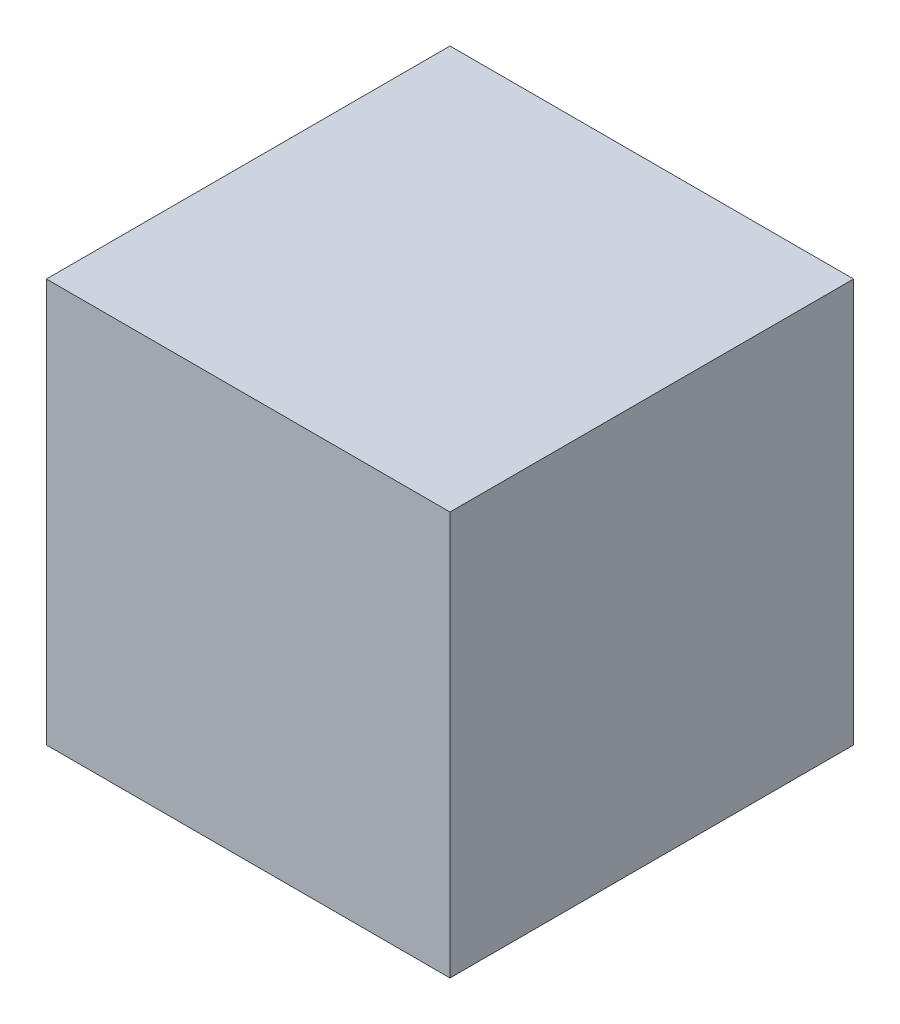
ISO-10303-21;
HEADER;
FILE_DESCRIPTION(('STEP AP214'),'2;1');
FILE_NAME('part.step','',(''),(''),'','','');
FILE_SCHEMA(('AUTOMOTIVE_DESIGN { 1 0 10303 214 1 1 1 1 }'));
ENDSEC;
DATA;
#1=APPLICATION_CONTEXT('core data for automotive mechanical design processes');
#2=APPLICATION_PROTOCOL_DEFINITION('international standard','automotive_design',2000,#1);
#3=PRODUCT_CONTEXT('',#1,'mechanical');
#4=PRODUCT('Part','Part','',(#3));
#5=PRODUCT_RELATED_PRODUCT_CATEGORY('part','',(#4));
#6=PRODUCT_DEFINITION_FORMATION('','',#4);
#7=PRODUCT_DEFINITION_CONTEXT('part definition',#1,'design');
#8=PRODUCT_DEFINITION('design','',#6,#7);
#9=PRODUCT_DEFINITION_SHAPE('','',#8);
#10=(LENGTH_UNIT() NAMED_UNIT(*) SI_UNIT(.MILLI.,.METRE.));
#11=(NAMED_UNIT(*) PLANE_ANGLE_UNIT() SI_UNIT($,.RADIAN.));
#12=(NAMED_UNIT(*) SI_UNIT($,.STERADIAN.) SOLID_ANGLE_UNIT());
#13=UNCERTAINTY_MEASURE_WITH_UNIT(LENGTH_MEASURE(1.E-05),#10,'distance_accuracy_value','');
#14=(GEOMETRIC_REPRESENTATION_CONTEXT(3) GLOBAL_UNCERTAINTY_ASSIGNED_CONTEXT((#13)) GLOBAL_UNIT_ASSIGNED_CONTEXT((#10,
#11,#12)) REPRESENTATION_CONTEXT('',''));
#15=CARTESIAN_POINT('',(0.,0.,0.));
#16=DIRECTION('',(0.,0.,1.));
#17=DIRECTION('',(1.,0.,0.));
#18=AXIS2_PLACEMENT_3D('',#15,#16,#17);
#19=CARTESIAN_POINT('',(432.377911124381,457.2,0.));
#20=DIRECTION('',(1.,0.,0.));
#21=DIRECTION('',(0.,0.,-1.));
#22=AXIS2_PLACEMENT_3D('',#19,#20,#21);
#23=PLANE('',#22);
#24=DIRECTION('',(0.,0.,1.));
#25=VECTOR('',#24,1.);
#26=CARTESIAN_POINT('',(432.377911124381,0.,0.));
#27=LINE('',#26,#25);
#28=CARTESIAN_POINT('',(432.377911124381,0.,-432.144839867333));
#29=VERTEX_POINT('',#28);
#30=CARTESIAN_POINT('',(432.377911124381,0.,25.0551601326673));
#31=VERTEX_POINT('',#30);
#32=EDGE_CURVE('E107',#29,#31,#27,.T.);
#33=ORIENTED_EDGE('',*,*,#32,.F.);
#34=DIRECTION('',(0.,-1.,0.));
#35=VECTOR('',#34,1.);
#36=CARTESIAN_POINT('',(432.377911124381,457.2,-432.144839867333));
#37=LINE('',#36,#35);
#38=CARTESIAN_POINT('',(432.377911124381,457.2,-432.144839867333));
#39=VERTEX_POINT('',#38);
#40=EDGE_CURVE('E11',#39,#29,#37,.T.);
#41=ORIENTED_EDGE('',*,*,#40,.F.);
#42=DIRECTION('',(0.,0.,1.));
#43=VECTOR('',#42,1.);
#44=CARTESIAN_POINT('',(432.377911124381,457.2,0.));
#45=LINE('',#44,#43);
#46=CARTESIAN_POINT('',(432.377911124381,457.2,25.0551601326673));
#47=VERTEX_POINT('',#46);
#48=EDGE_CURVE('E97',#39,#47,#45,.T.);
#49=ORIENTED_EDGE('',*,*,#48,.T.);
#50=DIRECTION('',(0.,-1.,0.));
#51=VECTOR('',#50,1.);
#52=CARTESIAN_POINT('',(432.377911124381,457.2,25.0551601326673));
#53=LINE('',#52,#51);
#54=EDGE_CURVE('E78',#47,#31,#53,.T.);
#55=ORIENTED_EDGE('',*,*,#54,.T.);
#56=EDGE_LOOP('',(#33,#41,#49,#55));
#57=FACE_BOUND('',#56,.T.);
#58=ADVANCED_FACE('F39',(#57),#23,.T.);
#59=CARTESIAN_POINT('',(0.,457.2,-432.144839867333));
#60=DIRECTION('',(0.,0.,-1.));
#61=DIRECTION('',(-1.,0.,0.));
#62=AXIS2_PLACEMENT_3D('',#59,#60,#61);
#63=PLANE('',#62);
#64=DIRECTION('',(1.,0.,0.));
#65=VECTOR('',#64,1.);
#66=CARTESIAN_POINT('',(0.,0.,-432.144839867333));
#67=LINE('',#66,#65);
#68=CARTESIAN_POINT('',(-24.8220888756192,0.,-432.144839867333));
#69=VERTEX_POINT('',#68);
#70=EDGE_CURVE('E89',#69,#29,#67,.T.);
#71=ORIENTED_EDGE('',*,*,#70,.F.);
#72=DIRECTION('',(0.,-1.,0.));
#73=VECTOR('',#72,1.);
#74=CARTESIAN_POINT('',(-24.8220888756192,457.2,-432.144839867333));
#75=LINE('',#74,#73);
#76=CARTESIAN_POINT('',(-24.8220888756192,457.2,-432.144839867333));
#77=VERTEX_POINT('',#76);
#78=EDGE_CURVE('E48',#77,#69,#75,.T.);
#79=ORIENTED_EDGE('',*,*,#78,.F.);
#80=DIRECTION('',(1.,0.,0.));
#81=VECTOR('',#80,1.);
#82=CARTESIAN_POINT('',(0.,457.2,-432.144839867333));
#83=LINE('',#82,#81);
#84=EDGE_CURVE('E87',#77,#39,#83,.T.);
#85=ORIENTED_EDGE('',*,*,#84,.T.);
#86=ORIENTED_EDGE('',*,*,#40,.T.);
#87=EDGE_LOOP('',(#71,#79,#85,#86));
#88=FACE_BOUND('',#87,.T.);
#89=ADVANCED_FACE('F86',(#88),#63,.T.);
#90=CARTESIAN_POINT('',(-24.8220888756192,457.2,0.));
#91=DIRECTION('',(-1.,0.,0.));
#92=DIRECTION('',(0.,0.,1.));
#93=AXIS2_PLACEMENT_3D('',#90,#91,#92);
#94=PLANE('',#93);
#95=DIRECTION('',(0.,0.,-1.));
#96=VECTOR('',#95,1.);
#97=CARTESIAN_POINT('',(-24.8220888756192,0.,0.));
#98=LINE('',#97,#96);
#99=CARTESIAN_POINT('',(-24.8220888756192,0.,25.0551601326673));
#100=VERTEX_POINT('',#99);
#101=EDGE_CURVE('E113',#100,#69,#98,.T.);
#102=ORIENTED_EDGE('',*,*,#101,.F.);
#103=DIRECTION('',(0.,-1.,0.));
#104=VECTOR('',#103,1.);
#105=CARTESIAN_POINT('',(-24.8220888756192,457.2,25.0551601326673));
#106=LINE('',#105,#104);
#107=CARTESIAN_POINT('',(-24.8220888756192,457.2,25.0551601326673));
#108=VERTEX_POINT('',#107);
#109=EDGE_CURVE('E71',#108,#100,#106,.T.);
#110=ORIENTED_EDGE('',*,*,#109,.F.);
#111=DIRECTION('',(0.,0.,-1.));
#112=VECTOR('',#111,1.);
#113=CARTESIAN_POINT('',(-24.8220888756192,457.2,0.));
#114=LINE('',#113,#112);
#115=EDGE_CURVE('E96',#108,#77,#114,.T.);
#116=ORIENTED_EDGE('',*,*,#115,.T.);
#117=ORIENTED_EDGE('',*,*,#78,.T.);
#118=EDGE_LOOP('',(#102,#110,#116,#117));
#119=FACE_BOUND('',#118,.T.);
#120=ADVANCED_FACE('F100',(#119),#94,.T.);
#121=CARTESIAN_POINT('',(0.,457.2,25.0551601326673));
#122=DIRECTION('',(0.,0.,-1.));
#123=DIRECTION('',(-1.,0.,0.));
#124=AXIS2_PLACEMENT_3D('',#121,#122,#123);
#125=PLANE('',#124);
#126=DIRECTION('',(1.,0.,0.));
#127=VECTOR('',#126,1.);
#128=CARTESIAN_POINT('',(0.,0.,25.0551601326673));
#129=LINE('',#128,#127);
#130=EDGE_CURVE('E116',#100,#31,#129,.T.);
#131=ORIENTED_EDGE('',*,*,#130,.T.);
#132=ORIENTED_EDGE('',*,*,#54,.F.);
#133=DIRECTION('',(1.,0.,0.));
#134=VECTOR('',#133,1.);
#135=CARTESIAN_POINT('',(0.,457.2,25.0551601326673));
#136=LINE('',#135,#134);
#137=EDGE_CURVE('E56',#108,#47,#136,.T.);
#138=ORIENTED_EDGE('',*,*,#137,.F.);
#139=ORIENTED_EDGE('',*,*,#109,.T.);
#140=EDGE_LOOP('',(#131,#132,#138,#139));
#141=FACE_BOUND('',#140,.T.);
#142=ADVANCED_FACE('F130',(#141),#125,.F.);
#143=CARTESIAN_POINT('',(0.,457.2,0.));
#144=DIRECTION('',(0.,1.,0.));
#145=DIRECTION('',(0.,0.,1.));
#146=AXIS2_PLACEMENT_3D('',#143,#144,#145);
#147=PLANE('',#146);
#148=ORIENTED_EDGE('',*,*,#48,.F.);
#149=ORIENTED_EDGE('',*,*,#84,.F.);
#150=ORIENTED_EDGE('',*,*,#115,.F.);
#151=ORIENTED_EDGE('',*,*,#137,.T.);
#152=EDGE_LOOP('',(#148,#149,#150,#151));
#153=FACE_BOUND('',#152,.T.);
#154=ADVANCED_FACE('F95',(#153),#147,.T.);
#155=CARTESIAN_POINT('',(0.,0.,0.));
#156=DIRECTION('',(0.,1.,0.));
#157=DIRECTION('',(0.,0.,1.));
#158=AXIS2_PLACEMENT_3D('',#155,#156,#157);
#159=PLANE('',#158);
#160=ORIENTED_EDGE('',*,*,#32,.T.);
#161=ORIENTED_EDGE('',*,*,#130,.F.);
#162=ORIENTED_EDGE('',*,*,#101,.T.);
#163=ORIENTED_EDGE('',*,*,#70,.T.);
#164=EDGE_LOOP('',(#160,#161,#162,#163));
#165=FACE_BOUND('',#164,.T.);
#166=ADVANCED_FACE('F135',(#165),#159,.F.);
#167=CLOSED_SHELL('',(#58,#89,#120,#142,#154,#166));
#168=MANIFOLD_SOLID_BREP('B2',#167);
#169=ADVANCED_BREP_SHAPE_REPRESENTATION('',(#18,#168),#14);
#170=SHAPE_DEFINITION_REPRESENTATION(#9,#169);
ENDSEC;
END-ISO-10303-21;
